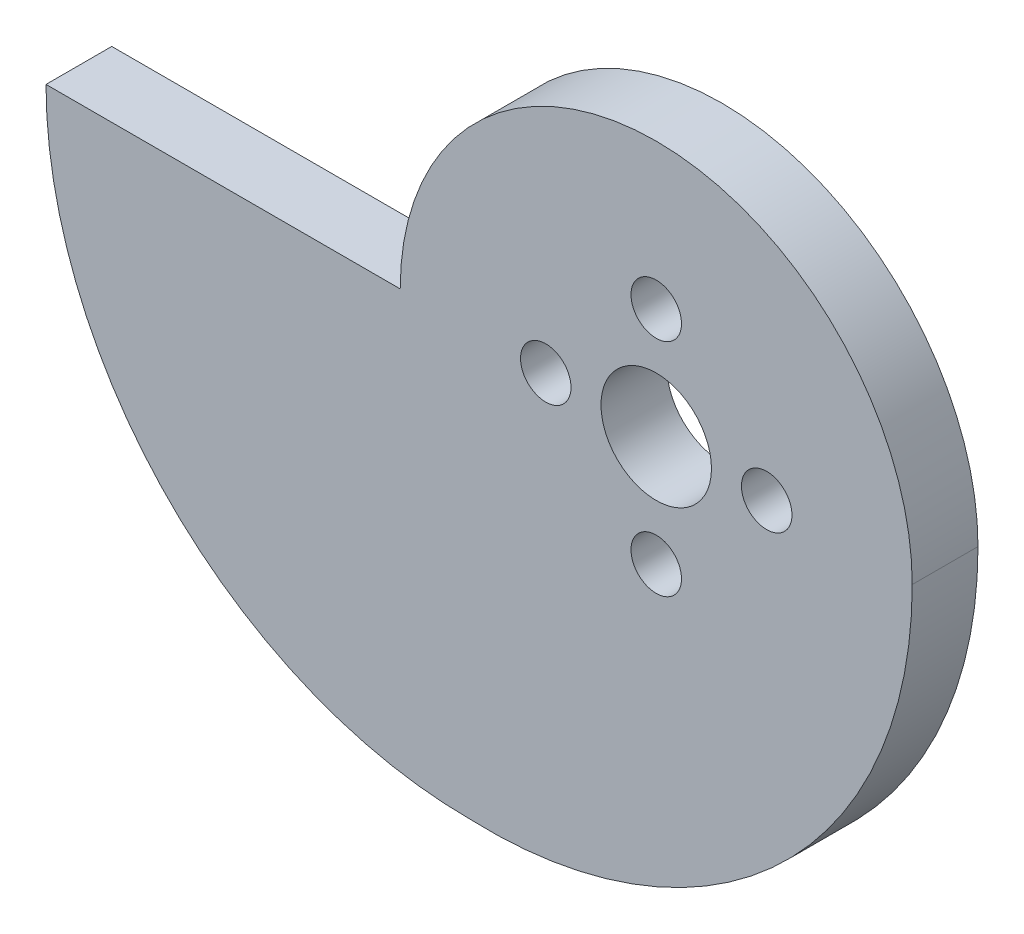
ISO-10303-21;
HEADER;
FILE_DESCRIPTION(('STEP AP214'),'2;1');
FILE_NAME('part.step','',(''),(''),'','','');
FILE_SCHEMA(('AUTOMOTIVE_DESIGN { 1 0 10303 214 1 1 1 1 }'));
ENDSEC;
DATA;
#1=APPLICATION_CONTEXT('core data for automotive mechanical design processes');
#2=APPLICATION_PROTOCOL_DEFINITION('international standard','automotive_design',2000,#1);
#3=PRODUCT_CONTEXT('',#1,'mechanical');
#4=PRODUCT('Part','Part','',(#3));
#5=PRODUCT_RELATED_PRODUCT_CATEGORY('part','',(#4));
#6=PRODUCT_DEFINITION_FORMATION('','',#4);
#7=PRODUCT_DEFINITION_CONTEXT('part definition',#1,'design');
#8=PRODUCT_DEFINITION('design','',#6,#7);
#9=PRODUCT_DEFINITION_SHAPE('','',#8);
#10=(LENGTH_UNIT() NAMED_UNIT(*) SI_UNIT(.MILLI.,.METRE.));
#11=(NAMED_UNIT(*) PLANE_ANGLE_UNIT() SI_UNIT($,.RADIAN.));
#12=(NAMED_UNIT(*) SI_UNIT($,.STERADIAN.) SOLID_ANGLE_UNIT());
#13=UNCERTAINTY_MEASURE_WITH_UNIT(LENGTH_MEASURE(1.E-05),#10,'distance_accuracy_value','');
#14=(GEOMETRIC_REPRESENTATION_CONTEXT(3) GLOBAL_UNCERTAINTY_ASSIGNED_CONTEXT((#13)) GLOBAL_UNIT_ASSIGNED_CONTEXT((#10,
#11,#12)) REPRESENTATION_CONTEXT('',''));
#15=CARTESIAN_POINT('',(0.,0.,0.));
#16=DIRECTION('',(0.,0.,1.));
#17=DIRECTION('',(1.,0.,0.));
#18=AXIS2_PLACEMENT_3D('',#15,#16,#17);
#19=CARTESIAN_POINT('',(0.,0.,4.7625));
#20=DIRECTION('',(0.,0.,-1.));
#21=DIRECTION('',(-1.,0.,0.));
#22=AXIS2_PLACEMENT_3D('',#19,#20,#21);
#23=PLANE('',#22);
#24=CARTESIAN_POINT('',(0.,8.,4.7625));
#25=DIRECTION('',(0.,0.,1.));
#26=DIRECTION('',(1.,0.,0.));
#27=AXIS2_PLACEMENT_3D('',#24,#25,#26);
#28=CIRCLE('',#27,1.8288);
#29=CARTESIAN_POINT('',(1.8288,8.,4.7625));
#30=VERTEX_POINT('',#29);
#31=EDGE_CURVE('E140',#30,#30,#28,.T.);
#32=ORIENTED_EDGE('',*,*,#31,.F.);
#33=EDGE_LOOP('',(#32));
#34=FACE_BOUND('',#33,.T.);
#35=CARTESIAN_POINT('',(8.,0.,4.7625));
#36=DIRECTION('',(0.,0.,1.));
#37=DIRECTION('',(1.,0.,0.));
#38=AXIS2_PLACEMENT_3D('',#35,#36,#37);
#39=CIRCLE('',#38,1.8288);
#40=CARTESIAN_POINT('',(9.8288,0.,4.7625));
#41=VERTEX_POINT('',#40);
#42=EDGE_CURVE('E134',#41,#41,#39,.T.);
#43=ORIENTED_EDGE('',*,*,#42,.F.);
#44=EDGE_LOOP('',(#43));
#45=FACE_BOUND('',#44,.T.);
#46=CARTESIAN_POINT('',(0.,-8.,4.7625));
#47=DIRECTION('',(0.,0.,1.));
#48=DIRECTION('',(1.,0.,0.));
#49=AXIS2_PLACEMENT_3D('',#46,#47,#48);
#50=CIRCLE('',#49,1.8288);
#51=CARTESIAN_POINT('',(1.82880000000005,-8.,4.7625));
#52=VERTEX_POINT('',#51);
#53=EDGE_CURVE('E128',#52,#52,#50,.T.);
#54=ORIENTED_EDGE('',*,*,#53,.F.);
#55=EDGE_LOOP('',(#54));
#56=FACE_BOUND('',#55,.T.);
#57=CARTESIAN_POINT('',(-8.,0.,4.7625));
#58=DIRECTION('',(0.,0.,1.));
#59=DIRECTION('',(1.,0.,0.));
#60=AXIS2_PLACEMENT_3D('',#57,#58,#59);
#61=CIRCLE('',#60,1.8288);
#62=CARTESIAN_POINT('',(-6.1712,0.,4.7625));
#63=VERTEX_POINT('',#62);
#64=EDGE_CURVE('E122',#63,#63,#61,.T.);
#65=ORIENTED_EDGE('',*,*,#64,.F.);
#66=EDGE_LOOP('',(#65));
#67=FACE_BOUND('',#66,.T.);
#68=CARTESIAN_POINT('',(0.,0.,4.7625));
#69=DIRECTION('',(0.,0.,1.));
#70=DIRECTION('',(-1.,0.,0.));
#71=AXIS2_PLACEMENT_3D('',#68,#69,#70);
#72=CIRCLE('',#71,18.542);
#73=CARTESIAN_POINT('',(18.542,0.,4.7625));
#74=VERTEX_POINT('',#73);
#75=CARTESIAN_POINT('',(-18.542,0.,4.7625));
#76=VERTEX_POINT('',#75);
#77=EDGE_CURVE('E87',#74,#76,#72,.T.);
#78=ORIENTED_EDGE('',*,*,#77,.T.);
#79=DIRECTION('',(-1.,0.,0.));
#80=VECTOR('',#79,1.);
#81=CARTESIAN_POINT('',(-44.196,0.,4.7625));
#82=LINE('',#81,#80);
#83=CARTESIAN_POINT('',(-44.196,0.,4.7625));
#84=VERTEX_POINT('',#83);
#85=EDGE_CURVE('E82',#76,#84,#82,.T.);
#86=ORIENTED_EDGE('',*,*,#85,.T.);
#87=CARTESIAN_POINT('',(-13.462,0.,4.7625));
#88=DIRECTION('',(0.,0.,1.));
#89=DIRECTION('',(1.,0.,0.));
#90=AXIS2_PLACEMENT_3D('',#87,#88,#89);
#91=CIRCLE('',#90,30.734);
#92=CARTESIAN_POINT('',(-13.462,-30.734,4.7625));
#93=VERTEX_POINT('',#92);
#94=EDGE_CURVE('E85',#84,#93,#91,.T.);
#95=ORIENTED_EDGE('',*,*,#94,.T.);
#96=CARTESIAN_POINT('',(-12.2171984126984,0.,4.7625));
#97=DIRECTION('',(0.,0.,1.));
#98=DIRECTION('',(-1.,0.,0.));
#99=AXIS2_PLACEMENT_3D('',#96,#97,#98);
#100=CIRCLE('',#99,30.7591984126984);
#101=EDGE_CURVE('E52',#93,#74,#100,.T.);
#102=ORIENTED_EDGE('',*,*,#101,.T.);
#103=EDGE_LOOP('',(#78,#86,#95,#102));
#104=FACE_BOUND('',#103,.T.);
#105=CARTESIAN_POINT('',(0.,0.,4.7625));
#106=DIRECTION('',(0.,0.,1.));
#107=DIRECTION('',(1.,0.,0.));
#108=AXIS2_PLACEMENT_3D('',#105,#106,#107);
#109=CIRCLE('',#108,4.);
#110=CARTESIAN_POINT('',(4.,0.,4.7625));
#111=VERTEX_POINT('',#110);
#112=EDGE_CURVE('E102',#111,#111,#109,.T.);
#113=ORIENTED_EDGE('',*,*,#112,.F.);
#114=EDGE_LOOP('',(#113));
#115=FACE_BOUND('',#114,.T.);
#116=ADVANCED_FACE('F35',(#34,#45,#56,#67,#104,#115),#23,.F.);
#117=CARTESIAN_POINT('',(0.,0.,0.));
#118=DIRECTION('',(0.,0.,-1.));
#119=DIRECTION('',(-1.,0.,0.));
#120=AXIS2_PLACEMENT_3D('',#117,#118,#119);
#121=PLANE('',#120);
#122=CARTESIAN_POINT('',(0.,8.,0.));
#123=DIRECTION('',(0.,0.,1.));
#124=DIRECTION('',(1.,0.,0.));
#125=AXIS2_PLACEMENT_3D('',#122,#123,#124);
#126=CIRCLE('',#125,1.8288);
#127=CARTESIAN_POINT('',(1.82879999999999,8.,0.));
#128=VERTEX_POINT('',#127);
#129=EDGE_CURVE('E137',#128,#128,#126,.T.);
#130=ORIENTED_EDGE('',*,*,#129,.T.);
#131=EDGE_LOOP('',(#130));
#132=FACE_BOUND('',#131,.T.);
#133=CARTESIAN_POINT('',(8.,0.,0.));
#134=DIRECTION('',(0.,0.,1.));
#135=DIRECTION('',(1.,0.,0.));
#136=AXIS2_PLACEMENT_3D('',#133,#134,#135);
#137=CIRCLE('',#136,1.8288);
#138=CARTESIAN_POINT('',(9.8288,0.,0.));
#139=VERTEX_POINT('',#138);
#140=EDGE_CURVE('E131',#139,#139,#137,.T.);
#141=ORIENTED_EDGE('',*,*,#140,.T.);
#142=EDGE_LOOP('',(#141));
#143=FACE_BOUND('',#142,.T.);
#144=CARTESIAN_POINT('',(0.,-8.,0.));
#145=DIRECTION('',(0.,0.,1.));
#146=DIRECTION('',(1.,0.,0.));
#147=AXIS2_PLACEMENT_3D('',#144,#145,#146);
#148=CIRCLE('',#147,1.8288);
#149=CARTESIAN_POINT('',(1.82880000000005,-8.,0.));
#150=VERTEX_POINT('',#149);
#151=EDGE_CURVE('E125',#150,#150,#148,.T.);
#152=ORIENTED_EDGE('',*,*,#151,.T.);
#153=EDGE_LOOP('',(#152));
#154=FACE_BOUND('',#153,.T.);
#155=CARTESIAN_POINT('',(-8.,0.,0.));
#156=DIRECTION('',(0.,0.,1.));
#157=DIRECTION('',(1.,0.,0.));
#158=AXIS2_PLACEMENT_3D('',#155,#156,#157);
#159=CIRCLE('',#158,1.8288);
#160=CARTESIAN_POINT('',(-6.17120000000001,0.,0.));
#161=VERTEX_POINT('',#160);
#162=EDGE_CURVE('E117',#161,#161,#159,.T.);
#163=ORIENTED_EDGE('',*,*,#162,.T.);
#164=EDGE_LOOP('',(#163));
#165=FACE_BOUND('',#164,.T.);
#166=CARTESIAN_POINT('',(0.,0.,0.));
#167=DIRECTION('',(0.,0.,1.));
#168=DIRECTION('',(-1.,0.,0.));
#169=AXIS2_PLACEMENT_3D('',#166,#167,#168);
#170=CIRCLE('',#169,18.542);
#171=CARTESIAN_POINT('',(18.542,0.,0.));
#172=VERTEX_POINT('',#171);
#173=CARTESIAN_POINT('',(-18.542,0.,0.));
#174=VERTEX_POINT('',#173);
#175=EDGE_CURVE('E99',#172,#174,#170,.T.);
#176=ORIENTED_EDGE('',*,*,#175,.F.);
#177=CARTESIAN_POINT('',(-12.2171984126984,0.,0.));
#178=DIRECTION('',(0.,0.,1.));
#179=DIRECTION('',(-1.,0.,0.));
#180=AXIS2_PLACEMENT_3D('',#177,#178,#179);
#181=CIRCLE('',#180,30.7591984126984);
#182=CARTESIAN_POINT('',(-13.462,-30.734,0.));
#183=VERTEX_POINT('',#182);
#184=EDGE_CURVE('E75',#183,#172,#181,.T.);
#185=ORIENTED_EDGE('',*,*,#184,.F.);
#186=CARTESIAN_POINT('',(-13.462,0.,0.));
#187=DIRECTION('',(0.,0.,1.));
#188=DIRECTION('',(1.,0.,0.));
#189=AXIS2_PLACEMENT_3D('',#186,#187,#188);
#190=CIRCLE('',#189,30.734);
#191=CARTESIAN_POINT('',(-44.196,0.,0.));
#192=VERTEX_POINT('',#191);
#193=EDGE_CURVE('E69',#192,#183,#190,.T.);
#194=ORIENTED_EDGE('',*,*,#193,.F.);
#195=DIRECTION('',(-1.,0.,0.));
#196=VECTOR('',#195,1.);
#197=CARTESIAN_POINT('',(-44.196,0.,0.));
#198=LINE('',#197,#196);
#199=EDGE_CURVE('E91',#174,#192,#198,.T.);
#200=ORIENTED_EDGE('',*,*,#199,.F.);
#201=EDGE_LOOP('',(#176,#185,#194,#200));
#202=FACE_BOUND('',#201,.T.);
#203=CARTESIAN_POINT('',(0.,0.,0.));
#204=DIRECTION('',(0.,0.,1.));
#205=DIRECTION('',(1.,0.,0.));
#206=AXIS2_PLACEMENT_3D('',#203,#204,#205);
#207=CIRCLE('',#206,4.);
#208=CARTESIAN_POINT('',(4.,0.,0.));
#209=VERTEX_POINT('',#208);
#210=EDGE_CURVE('E114',#209,#209,#207,.T.);
#211=ORIENTED_EDGE('',*,*,#210,.T.);
#212=EDGE_LOOP('',(#211));
#213=FACE_BOUND('',#212,.T.);
#214=ADVANCED_FACE('F110',(#132,#143,#154,#165,#202,#213),#121,.T.);
#215=CARTESIAN_POINT('',(0.,0.,4.7625));
#216=DIRECTION('',(0.,0.,-1.));
#217=DIRECTION('',(-1.,0.,0.));
#218=AXIS2_PLACEMENT_3D('',#215,#216,#217);
#219=CYLINDRICAL_SURFACE('',#218,18.542);
#220=ORIENTED_EDGE('',*,*,#175,.T.);
#221=DIRECTION('',(0.,0.,-1.));
#222=VECTOR('',#221,1.);
#223=CARTESIAN_POINT('',(-18.542,0.,4.7625));
#224=LINE('',#223,#222);
#225=EDGE_CURVE('E11',#76,#174,#224,.T.);
#226=ORIENTED_EDGE('',*,*,#225,.F.);
#227=ORIENTED_EDGE('',*,*,#77,.F.);
#228=DIRECTION('',(0.,0.,-1.));
#229=VECTOR('',#228,1.);
#230=CARTESIAN_POINT('',(18.542,0.,4.7625));
#231=LINE('',#230,#229);
#232=EDGE_CURVE('E95',#74,#172,#231,.T.);
#233=ORIENTED_EDGE('',*,*,#232,.T.);
#234=EDGE_LOOP('',(#220,#226,#227,#233));
#235=FACE_BOUND('',#234,.T.);
#236=ADVANCED_FACE('F37',(#235),#219,.T.);
#237=CARTESIAN_POINT('',(-44.196,0.,4.7625));
#238=DIRECTION('',(0.,-1.,0.));
#239=DIRECTION('',(0.,0.,-1.));
#240=AXIS2_PLACEMENT_3D('',#237,#238,#239);
#241=PLANE('',#240);
#242=ORIENTED_EDGE('',*,*,#199,.T.);
#243=DIRECTION('',(0.,0.,-1.));
#244=VECTOR('',#243,1.);
#245=CARTESIAN_POINT('',(-44.196,0.,4.7625));
#246=LINE('',#245,#244);
#247=EDGE_CURVE('E44',#84,#192,#246,.T.);
#248=ORIENTED_EDGE('',*,*,#247,.F.);
#249=ORIENTED_EDGE('',*,*,#85,.F.);
#250=ORIENTED_EDGE('',*,*,#225,.T.);
#251=EDGE_LOOP('',(#242,#248,#249,#250));
#252=FACE_BOUND('',#251,.T.);
#253=ADVANCED_FACE('F90',(#252),#241,.F.);
#254=CARTESIAN_POINT('',(-13.462,0.,4.7625));
#255=DIRECTION('',(0.,0.,-1.));
#256=DIRECTION('',(-1.,0.,0.));
#257=AXIS2_PLACEMENT_3D('',#254,#255,#256);
#258=CYLINDRICAL_SURFACE('',#257,30.734);
#259=ORIENTED_EDGE('',*,*,#193,.T.);
#260=DIRECTION('',(0.,0.,-1.));
#261=VECTOR('',#260,1.);
#262=CARTESIAN_POINT('',(-13.462,-30.734,4.7625));
#263=LINE('',#262,#261);
#264=EDGE_CURVE('E92',#93,#183,#263,.T.);
#265=ORIENTED_EDGE('',*,*,#264,.F.);
#266=ORIENTED_EDGE('',*,*,#94,.F.);
#267=ORIENTED_EDGE('',*,*,#247,.T.);
#268=EDGE_LOOP('',(#259,#265,#266,#267));
#269=FACE_BOUND('',#268,.T.);
#270=ADVANCED_FACE('F93',(#269),#258,.T.);
#271=CARTESIAN_POINT('',(-12.2171984126984,0.,4.7625));
#272=DIRECTION('',(0.,0.,-1.));
#273=DIRECTION('',(-1.,0.,0.));
#274=AXIS2_PLACEMENT_3D('',#271,#272,#273);
#275=CYLINDRICAL_SURFACE('',#274,30.7591984126984);
#276=ORIENTED_EDGE('',*,*,#184,.T.);
#277=ORIENTED_EDGE('',*,*,#232,.F.);
#278=ORIENTED_EDGE('',*,*,#101,.F.);
#279=ORIENTED_EDGE('',*,*,#264,.T.);
#280=EDGE_LOOP('',(#276,#277,#278,#279));
#281=FACE_BOUND('',#280,.T.);
#282=ADVANCED_FACE('F107',(#281),#275,.T.);
#283=CARTESIAN_POINT('',(0.,0.,4.7625));
#284=DIRECTION('',(0.,0.,-1.));
#285=DIRECTION('',(-1.,0.,0.));
#286=AXIS2_PLACEMENT_3D('',#283,#284,#285);
#287=CYLINDRICAL_SURFACE('',#286,4.);
#288=ORIENTED_EDGE('',*,*,#112,.T.);
#289=EDGE_LOOP('',(#288));
#290=FACE_BOUND('',#289,.T.);
#291=ORIENTED_EDGE('',*,*,#210,.F.);
#292=EDGE_LOOP('',(#291));
#293=FACE_BOUND('',#292,.T.);
#294=ADVANCED_FACE('F158',(#290,#293),#287,.F.);
#295=CARTESIAN_POINT('',(-8.,0.,4.7625));
#296=DIRECTION('',(0.,0.,1.));
#297=DIRECTION('',(1.,0.,0.));
#298=AXIS2_PLACEMENT_3D('',#295,#296,#297);
#299=CYLINDRICAL_SURFACE('',#298,1.8288);
#300=ORIENTED_EDGE('',*,*,#162,.F.);
#301=EDGE_LOOP('',(#300));
#302=FACE_BOUND('',#301,.T.);
#303=ORIENTED_EDGE('',*,*,#64,.T.);
#304=EDGE_LOOP('',(#303));
#305=FACE_BOUND('',#304,.T.);
#306=ADVANCED_FACE('F155',(#302,#305),#299,.F.);
#307=CARTESIAN_POINT('',(0.,-8.,4.7625));
#308=DIRECTION('',(0.,0.,1.));
#309=DIRECTION('',(1.,0.,0.));
#310=AXIS2_PLACEMENT_3D('',#307,#308,#309);
#311=CYLINDRICAL_SURFACE('',#310,1.8288);
#312=ORIENTED_EDGE('',*,*,#151,.F.);
#313=EDGE_LOOP('',(#312));
#314=FACE_BOUND('',#313,.T.);
#315=ORIENTED_EDGE('',*,*,#53,.T.);
#316=EDGE_LOOP('',(#315));
#317=FACE_BOUND('',#316,.T.);
#318=ADVANCED_FACE('F157',(#314,#317),#311,.F.);
#319=CARTESIAN_POINT('',(8.,0.,4.7625));
#320=DIRECTION('',(0.,0.,1.));
#321=DIRECTION('',(1.,0.,0.));
#322=AXIS2_PLACEMENT_3D('',#319,#320,#321);
#323=CYLINDRICAL_SURFACE('',#322,1.8288);
#324=ORIENTED_EDGE('',*,*,#140,.F.);
#325=EDGE_LOOP('',(#324));
#326=FACE_BOUND('',#325,.T.);
#327=ORIENTED_EDGE('',*,*,#42,.T.);
#328=EDGE_LOOP('',(#327));
#329=FACE_BOUND('',#328,.T.);
#330=ADVANCED_FACE('F165',(#326,#329),#323,.F.);
#331=CARTESIAN_POINT('',(0.,8.,4.7625));
#332=DIRECTION('',(0.,0.,1.));
#333=DIRECTION('',(1.,0.,0.));
#334=AXIS2_PLACEMENT_3D('',#331,#332,#333);
#335=CYLINDRICAL_SURFACE('',#334,1.8288);
#336=ORIENTED_EDGE('',*,*,#129,.F.);
#337=EDGE_LOOP('',(#336));
#338=FACE_BOUND('',#337,.T.);
#339=ORIENTED_EDGE('',*,*,#31,.T.);
#340=EDGE_LOOP('',(#339));
#341=FACE_BOUND('',#340,.T.);
#342=ADVANCED_FACE('F144',(#338,#341),#335,.F.);
#343=CLOSED_SHELL('',(#116,#214,#236,#253,#270,#282,#294,#306,#318,#330,#342));
#344=MANIFOLD_SOLID_BREP('B2',#343);
#345=ADVANCED_BREP_SHAPE_REPRESENTATION('',(#18,#344),#14);
#346=SHAPE_DEFINITION_REPRESENTATION(#9,#345);
ENDSEC;
END-ISO-10303-21;
